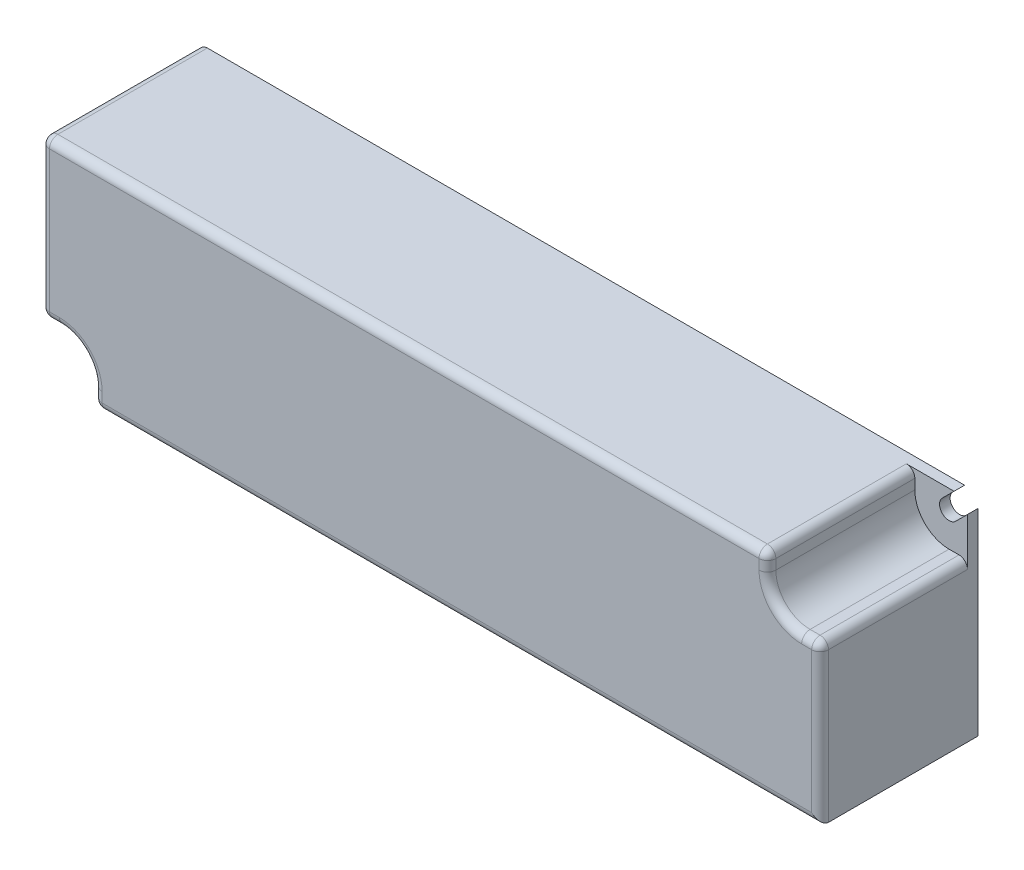
ISO-10303-21;
HEADER;
FILE_DESCRIPTION(('STEP AP214'),'2;1');
FILE_NAME('part.step','',(''),(''),'','','');
FILE_SCHEMA(('AUTOMOTIVE_DESIGN { 1 0 10303 214 1 1 1 1 }'));
ENDSEC;
DATA;
#1=APPLICATION_CONTEXT('core data for automotive mechanical design processes');
#2=APPLICATION_PROTOCOL_DEFINITION('international standard','automotive_design',2000,#1);
#3=PRODUCT_CONTEXT('',#1,'mechanical');
#4=PRODUCT('Part','Part','',(#3));
#5=PRODUCT_RELATED_PRODUCT_CATEGORY('part','',(#4));
#6=PRODUCT_DEFINITION_FORMATION('','',#4);
#7=PRODUCT_DEFINITION_CONTEXT('part definition',#1,'design');
#8=PRODUCT_DEFINITION('design','',#6,#7);
#9=PRODUCT_DEFINITION_SHAPE('','',#8);
#10=(LENGTH_UNIT() NAMED_UNIT(*) SI_UNIT(.MILLI.,.METRE.));
#11=(NAMED_UNIT(*) PLANE_ANGLE_UNIT() SI_UNIT($,.RADIAN.));
#12=(NAMED_UNIT(*) SI_UNIT($,.STERADIAN.) SOLID_ANGLE_UNIT());
#13=UNCERTAINTY_MEASURE_WITH_UNIT(LENGTH_MEASURE(1.E-05),#10,'distance_accuracy_value','');
#14=(GEOMETRIC_REPRESENTATION_CONTEXT(3) GLOBAL_UNCERTAINTY_ASSIGNED_CONTEXT((#13)) GLOBAL_UNIT_ASSIGNED_CONTEXT((#10,
#11,#12)) REPRESENTATION_CONTEXT('',''));
#15=CARTESIAN_POINT('',(0.,0.,0.));
#16=DIRECTION('',(0.,0.,1.));
#17=DIRECTION('',(1.,0.,0.));
#18=AXIS2_PLACEMENT_3D('',#15,#16,#17);
#19=CARTESIAN_POINT('',(-69.2272077938643,-17.7727922061353,0.));
#20=DIRECTION('',(0.707106781186543,-0.707106781186552,0.));
#21=DIRECTION('',(0.707106781186552,0.707106781186543,0.));
#22=AXIS2_PLACEMENT_3D('',#19,#20,#21);
#23=PLANE('',#22);
#24=DIRECTION('',(-0.707106781186552,-0.707106781186543,0.));
#25=VECTOR('',#24,1.);
#26=CARTESIAN_POINT('',(-69.2272077938643,-17.7727922061353,2.));
#27=LINE('',#26,#25);
#28=CARTESIAN_POINT('',(-69.2272077938643,-17.7727922061353,2.));
#29=VERTEX_POINT('',#28);
#30=CARTESIAN_POINT('',(-71.454415587729,-20.,2.));
#31=VERTEX_POINT('',#30);
#32=EDGE_CURVE('E248',#29,#31,#27,.T.);
#33=ORIENTED_EDGE('',*,*,#32,.F.);
#34=DIRECTION('',(0.,0.,1.));
#35=VECTOR('',#34,1.);
#36=CARTESIAN_POINT('',(-69.2272077938643,-17.7727922061353,0.));
#37=LINE('',#36,#35);
#38=CARTESIAN_POINT('',(-69.2272077938643,-17.7727922061353,0.));
#39=VERTEX_POINT('',#38);
#40=EDGE_CURVE('E282',#39,#29,#37,.T.);
#41=ORIENTED_EDGE('',*,*,#40,.F.);
#42=DIRECTION('',(0.707106781186552,0.707106781186543,0.));
#43=VECTOR('',#42,1.);
#44=CARTESIAN_POINT('',(-25.7272077938641,25.7272077938644,0.));
#45=LINE('',#44,#43);
#46=CARTESIAN_POINT('',(-71.454415587729,-20.,0.));
#47=VERTEX_POINT('',#46);
#48=EDGE_CURVE('E325',#47,#39,#45,.T.);
#49=ORIENTED_EDGE('',*,*,#48,.F.);
#50=DIRECTION('',(0.,0.,-1.));
#51=VECTOR('',#50,1.);
#52=CARTESIAN_POINT('',(-71.454415587729,-20.,30.));
#53=LINE('',#52,#51);
#54=EDGE_CURVE('E290',#31,#47,#53,.T.);
#55=ORIENTED_EDGE('',*,*,#54,.F.);
#56=EDGE_LOOP('',(#33,#41,#49,#55));
#57=FACE_BOUND('',#56,.T.);
#58=ADVANCED_FACE('F33',(#57),#23,.F.);
#59=CARTESIAN_POINT('',(-71.7727922061359,-15.2272077938637,0.));
#60=DIRECTION('',(-0.707106781186533,0.707106781186562,0.));
#61=DIRECTION('',(-0.707106781186562,-0.707106781186533,0.));
#62=AXIS2_PLACEMENT_3D('',#59,#60,#61);
#63=PLANE('',#62);
#64=DIRECTION('',(0.707106781186562,0.707106781186533,0.));
#65=VECTOR('',#64,1.);
#66=CARTESIAN_POINT('',(-71.7727922061359,-15.2272077938637,2.));
#67=LINE('',#66,#65);
#68=CARTESIAN_POINT('',(-74.,-17.4544155877278,2.));
#69=VERTEX_POINT('',#68);
#70=CARTESIAN_POINT('',(-71.7727922061359,-15.2272077938637,2.));
#71=VERTEX_POINT('',#70);
#72=EDGE_CURVE('E245',#69,#71,#67,.T.);
#73=ORIENTED_EDGE('',*,*,#72,.F.);
#74=DIRECTION('',(0.,0.,1.));
#75=VECTOR('',#74,1.);
#76=CARTESIAN_POINT('',(-74.,-17.4544155877278,30.));
#77=LINE('',#76,#75);
#78=CARTESIAN_POINT('',(-74.,-17.4544155877278,0.));
#79=VERTEX_POINT('',#78);
#80=EDGE_CURVE('E285',#79,#69,#77,.T.);
#81=ORIENTED_EDGE('',*,*,#80,.F.);
#82=DIRECTION('',(-0.707106781186562,-0.707106781186533,0.));
#83=VECTOR('',#82,1.);
#84=CARTESIAN_POINT('',(-71.7727922061359,-15.2272077938637,0.));
#85=LINE('',#84,#83);
#86=CARTESIAN_POINT('',(-71.7727922061359,-15.2272077938637,0.));
#87=VERTEX_POINT('',#86);
#88=EDGE_CURVE('E278',#87,#79,#85,.T.);
#89=ORIENTED_EDGE('',*,*,#88,.F.);
#90=DIRECTION('',(0.,0.,1.));
#91=VECTOR('',#90,1.);
#92=CARTESIAN_POINT('',(-71.7727922061359,-15.2272077938637,0.));
#93=LINE('',#92,#91);
#94=EDGE_CURVE('E281',#87,#71,#93,.T.);
#95=ORIENTED_EDGE('',*,*,#94,.T.);
#96=EDGE_LOOP('',(#73,#81,#89,#95));
#97=FACE_BOUND('',#96,.T.);
#98=ADVANCED_FACE('F486',(#97),#63,.F.);
#99=CARTESIAN_POINT('',(-70.5000000000001,-16.4999999999995,0.));
#100=DIRECTION('',(0.,0.,1.));
#101=DIRECTION('',(1.,0.,0.));
#102=AXIS2_PLACEMENT_3D('',#99,#100,#101);
#103=CYLINDRICAL_SURFACE('',#102,1.8);
#104=CARTESIAN_POINT('',(-70.5000000000001,-16.4999999999995,2.));
#105=DIRECTION('',(0.,0.,1.));
#106=DIRECTION('',(1.,0.,0.));
#107=AXIS2_PLACEMENT_3D('',#104,#105,#106);
#108=CIRCLE('',#107,1.8);
#109=EDGE_CURVE('E330',#71,#29,#108,.F.);
#110=ORIENTED_EDGE('',*,*,#109,.F.);
#111=ORIENTED_EDGE('',*,*,#94,.F.);
#112=CARTESIAN_POINT('',(-70.5000000000001,-16.4999999999995,0.));
#113=DIRECTION('',(0.,0.,1.));
#114=DIRECTION('',(1.,0.,0.));
#115=AXIS2_PLACEMENT_3D('',#112,#113,#114);
#116=CIRCLE('',#115,1.8);
#117=EDGE_CURVE('E275',#39,#87,#116,.T.);
#118=ORIENTED_EDGE('',*,*,#117,.F.);
#119=ORIENTED_EDGE('',*,*,#40,.T.);
#120=EDGE_LOOP('',(#110,#111,#118,#119));
#121=FACE_BOUND('',#120,.T.);
#122=ADVANCED_FACE('F490',(#121),#103,.F.);
#123=CARTESIAN_POINT('',(69.2272077938642,17.7727922061358,0.));
#124=DIRECTION('',(-0.707106781186548,0.707106781186547,0.));
#125=DIRECTION('',(-0.707106781186547,-0.707106781186548,0.));
#126=AXIS2_PLACEMENT_3D('',#123,#124,#125);
#127=PLANE('',#126);
#128=DIRECTION('',(0.707106781186547,0.707106781186548,0.));
#129=VECTOR('',#128,1.);
#130=CARTESIAN_POINT('',(69.2272077938642,17.7727922061358,2.));
#131=LINE('',#130,#129);
#132=CARTESIAN_POINT('',(69.2272077938642,17.7727922061358,2.));
#133=VERTEX_POINT('',#132);
#134=CARTESIAN_POINT('',(71.4544155877284,20.,2.));
#135=VERTEX_POINT('',#134);
#136=EDGE_CURVE('E269',#133,#135,#131,.T.);
#137=ORIENTED_EDGE('',*,*,#136,.F.);
#138=DIRECTION('',(0.,0.,1.));
#139=VECTOR('',#138,1.);
#140=CARTESIAN_POINT('',(69.2272077938642,17.7727922061358,0.));
#141=LINE('',#140,#139);
#142=CARTESIAN_POINT('',(69.2272077938642,17.7727922061358,0.));
#143=VERTEX_POINT('',#142);
#144=EDGE_CURVE('E299',#143,#133,#141,.T.);
#145=ORIENTED_EDGE('',*,*,#144,.F.);
#146=DIRECTION('',(-0.707106781186547,-0.707106781186548,0.));
#147=VECTOR('',#146,1.);
#148=CARTESIAN_POINT('',(25.7272077938643,-25.7272077938642,0.));
#149=LINE('',#148,#147);
#150=CARTESIAN_POINT('',(71.4544155877284,20.,0.));
#151=VERTEX_POINT('',#150);
#152=EDGE_CURVE('E322',#151,#143,#149,.T.);
#153=ORIENTED_EDGE('',*,*,#152,.F.);
#154=DIRECTION('',(0.,0.,-1.));
#155=VECTOR('',#154,1.);
#156=CARTESIAN_POINT('',(71.4544155877284,20.,30.));
#157=LINE('',#156,#155);
#158=EDGE_CURVE('E307',#135,#151,#157,.T.);
#159=ORIENTED_EDGE('',*,*,#158,.F.);
#160=EDGE_LOOP('',(#137,#145,#153,#159));
#161=FACE_BOUND('',#160,.T.);
#162=ADVANCED_FACE('F586',(#161),#127,.F.);
#163=CARTESIAN_POINT('',(71.7727922061358,15.2272077938642,0.));
#164=DIRECTION('',(0.707106781186538,-0.707106781186557,0.));
#165=DIRECTION('',(0.707106781186557,0.707106781186538,0.));
#166=AXIS2_PLACEMENT_3D('',#163,#164,#165);
#167=PLANE('',#166);
#168=DIRECTION('',(-0.707106781186557,-0.707106781186538,0.));
#169=VECTOR('',#168,1.);
#170=CARTESIAN_POINT('',(71.7727922061358,15.2272077938642,2.));
#171=LINE('',#170,#169);
#172=CARTESIAN_POINT('',(74.,17.4544155877284,2.));
#173=VERTEX_POINT('',#172);
#174=CARTESIAN_POINT('',(71.7727922061358,15.2272077938642,2.));
#175=VERTEX_POINT('',#174);
#176=EDGE_CURVE('E265',#173,#175,#171,.T.);
#177=ORIENTED_EDGE('',*,*,#176,.F.);
#178=DIRECTION('',(0.,0.,1.));
#179=VECTOR('',#178,1.);
#180=CARTESIAN_POINT('',(74.,17.4544155877284,30.));
#181=LINE('',#180,#179);
#182=CARTESIAN_POINT('',(74.,17.4544155877284,0.));
#183=VERTEX_POINT('',#182);
#184=EDGE_CURVE('E302',#183,#173,#181,.T.);
#185=ORIENTED_EDGE('',*,*,#184,.F.);
#186=DIRECTION('',(0.707106781186557,0.707106781186538,0.));
#187=VECTOR('',#186,1.);
#188=CARTESIAN_POINT('',(71.7727922061358,15.2272077938642,0.));
#189=LINE('',#188,#187);
#190=CARTESIAN_POINT('',(71.7727922061358,15.2272077938642,0.));
#191=VERTEX_POINT('',#190);
#192=EDGE_CURVE('E295',#191,#183,#189,.T.);
#193=ORIENTED_EDGE('',*,*,#192,.F.);
#194=DIRECTION('',(0.,0.,1.));
#195=VECTOR('',#194,1.);
#196=CARTESIAN_POINT('',(71.7727922061358,15.2272077938642,0.));
#197=LINE('',#196,#195);
#198=EDGE_CURVE('E298',#191,#175,#197,.T.);
#199=ORIENTED_EDGE('',*,*,#198,.T.);
#200=EDGE_LOOP('',(#177,#185,#193,#199));
#201=FACE_BOUND('',#200,.T.);
#202=ADVANCED_FACE('F578',(#201),#167,.F.);
#203=CARTESIAN_POINT('',(70.5,16.5,0.));
#204=DIRECTION('',(0.,0.,1.));
#205=DIRECTION('',(1.,0.,0.));
#206=AXIS2_PLACEMENT_3D('',#203,#204,#205);
#207=CYLINDRICAL_SURFACE('',#206,1.8);
#208=CARTESIAN_POINT('',(70.5,16.5,2.));
#209=DIRECTION('',(0.,0.,1.));
#210=DIRECTION('',(1.,0.,0.));
#211=AXIS2_PLACEMENT_3D('',#208,#209,#210);
#212=CIRCLE('',#211,1.8);
#213=EDGE_CURVE('E328',#175,#133,#212,.F.);
#214=ORIENTED_EDGE('',*,*,#213,.F.);
#215=ORIENTED_EDGE('',*,*,#198,.F.);
#216=CARTESIAN_POINT('',(70.5,16.5,0.));
#217=DIRECTION('',(0.,0.,1.));
#218=DIRECTION('',(1.,0.,0.));
#219=AXIS2_PLACEMENT_3D('',#216,#217,#218);
#220=CIRCLE('',#219,1.8);
#221=EDGE_CURVE('E292',#143,#191,#220,.T.);
#222=ORIENTED_EDGE('',*,*,#221,.F.);
#223=ORIENTED_EDGE('',*,*,#144,.T.);
#224=EDGE_LOOP('',(#214,#215,#222,#223));
#225=FACE_BOUND('',#224,.T.);
#226=ADVANCED_FACE('F581',(#225),#207,.F.);
#227=CARTESIAN_POINT('',(74.,20.,30.));
#228=DIRECTION('',(-1.,0.,0.));
#229=DIRECTION('',(0.,-1.,0.));
#230=AXIS2_PLACEMENT_3D('',#227,#228,#229);
#231=PLANE('',#230);
#232=DIRECTION('',(0.,1.,0.));
#233=VECTOR('',#232,1.);
#234=CARTESIAN_POINT('',(74.,20.,2.));
#235=LINE('',#234,#233);
#236=CARTESIAN_POINT('',(74.,8.40000000000001,2.));
#237=VERTEX_POINT('',#236);
#238=EDGE_CURVE('E273',#237,#173,#235,.T.);
#239=ORIENTED_EDGE('',*,*,#238,.F.);
#240=DIRECTION('',(0.,0.,1.));
#241=VECTOR('',#240,1.);
#242=CARTESIAN_POINT('',(74.,8.40000000000001,30.));
#243=LINE('',#242,#241);
#244=CARTESIAN_POINT('',(74.,8.40000000000001,28.4));
#245=VERTEX_POINT('',#244);
#246=EDGE_CURVE('E371',#237,#245,#243,.T.);
#247=ORIENTED_EDGE('',*,*,#246,.T.);
#248=DIRECTION('',(0.,1.,0.));
#249=VECTOR('',#248,1.);
#250=CARTESIAN_POINT('',(74.,-20.,28.4));
#251=LINE('',#250,#249);
#252=CARTESIAN_POINT('',(74.,-20.,28.4));
#253=VERTEX_POINT('',#252);
#254=EDGE_CURVE('E369',#245,#253,#251,.F.);
#255=ORIENTED_EDGE('',*,*,#254,.T.);
#256=DIRECTION('',(0.,0.,-1.));
#257=VECTOR('',#256,1.);
#258=CARTESIAN_POINT('',(74.,-20.,30.));
#259=LINE('',#258,#257);
#260=CARTESIAN_POINT('',(74.,-20.,0.));
#261=VERTEX_POINT('',#260);
#262=EDGE_CURVE('E320',#253,#261,#259,.T.);
#263=ORIENTED_EDGE('',*,*,#262,.T.);
#264=DIRECTION('',(0.,1.,0.));
#265=VECTOR('',#264,1.);
#266=CARTESIAN_POINT('',(74.,20.,0.));
#267=LINE('',#266,#265);
#268=EDGE_CURVE('E309',#261,#183,#267,.T.);
#269=ORIENTED_EDGE('',*,*,#268,.T.);
#270=ORIENTED_EDGE('',*,*,#184,.T.);
#271=EDGE_LOOP('',(#239,#247,#255,#263,#269,#270));
#272=FACE_BOUND('',#271,.T.);
#273=ADVANCED_FACE('F533',(#272),#231,.F.);
#274=CARTESIAN_POINT('',(-74.,20.,30.));
#275=DIRECTION('',(0.,-1.,0.));
#276=DIRECTION('',(0.,0.,-1.));
#277=AXIS2_PLACEMENT_3D('',#274,#275,#276);
#278=PLANE('',#277);
#279=DIRECTION('',(0.,0.,-1.));
#280=VECTOR('',#279,1.);
#281=CARTESIAN_POINT('',(62.4,20.,30.));
#282=LINE('',#281,#280);
#283=CARTESIAN_POINT('',(62.4,20.,28.4));
#284=VERTEX_POINT('',#283);
#285=CARTESIAN_POINT('',(62.4,20.,2.));
#286=VERTEX_POINT('',#285);
#287=EDGE_CURVE('E379',#284,#286,#282,.T.);
#288=ORIENTED_EDGE('',*,*,#287,.T.);
#289=DIRECTION('',(-1.,0.,0.));
#290=VECTOR('',#289,1.);
#291=CARTESIAN_POINT('',(-74.,20.,2.));
#292=LINE('',#291,#290);
#293=EDGE_CURVE('E271',#135,#286,#292,.T.);
#294=ORIENTED_EDGE('',*,*,#293,.F.);
#295=ORIENTED_EDGE('',*,*,#158,.T.);
#296=DIRECTION('',(-1.,0.,0.));
#297=VECTOR('',#296,1.);
#298=CARTESIAN_POINT('',(-74.,20.,0.));
#299=LINE('',#298,#297);
#300=CARTESIAN_POINT('',(-72.4,20.,0.));
#301=VERTEX_POINT('',#300);
#302=EDGE_CURVE('E312',#151,#301,#299,.T.);
#303=ORIENTED_EDGE('',*,*,#302,.T.);
#304=DIRECTION('',(0.,0.,-1.));
#305=VECTOR('',#304,1.);
#306=CARTESIAN_POINT('',(-72.4,20.,30.));
#307=LINE('',#306,#305);
#308=CARTESIAN_POINT('',(-72.4,20.,28.4));
#309=VERTEX_POINT('',#308);
#310=EDGE_CURVE('E377',#301,#309,#307,.F.);
#311=ORIENTED_EDGE('',*,*,#310,.T.);
#312=DIRECTION('',(-1.,0.,0.));
#313=VECTOR('',#312,1.);
#314=CARTESIAN_POINT('',(64.,20.,28.4));
#315=LINE('',#314,#313);
#316=EDGE_CURVE('E375',#309,#284,#315,.F.);
#317=ORIENTED_EDGE('',*,*,#316,.T.);
#318=EDGE_LOOP('',(#288,#294,#295,#303,#311,#317));
#319=FACE_BOUND('',#318,.T.);
#320=ADVANCED_FACE('F589',(#319),#278,.F.);
#321=CARTESIAN_POINT('',(-74.,20.,30.));
#322=DIRECTION('',(1.,0.,0.));
#323=DIRECTION('',(0.,0.,-1.));
#324=AXIS2_PLACEMENT_3D('',#321,#322,#323);
#325=PLANE('',#324);
#326=DIRECTION('',(0.,-1.,0.));
#327=VECTOR('',#326,1.);
#328=CARTESIAN_POINT('',(-74.,20.,2.));
#329=LINE('',#328,#327);
#330=CARTESIAN_POINT('',(-74.,-8.39999999999917,2.));
#331=VERTEX_POINT('',#330);
#332=EDGE_CURVE('E251',#331,#69,#329,.T.);
#333=ORIENTED_EDGE('',*,*,#332,.F.);
#334=DIRECTION('',(0.,0.,1.));
#335=VECTOR('',#334,1.);
#336=CARTESIAN_POINT('',(-74.,-8.39999999999917,30.));
#337=LINE('',#336,#335);
#338=CARTESIAN_POINT('',(-74.,-8.39999999999917,28.4));
#339=VERTEX_POINT('',#338);
#340=EDGE_CURVE('E384',#331,#339,#337,.T.);
#341=ORIENTED_EDGE('',*,*,#340,.T.);
#342=DIRECTION('',(0.,-1.,0.));
#343=VECTOR('',#342,1.);
#344=CARTESIAN_POINT('',(-74.,20.,28.4));
#345=LINE('',#344,#343);
#346=CARTESIAN_POINT('',(-74.,18.4,28.4));
#347=VERTEX_POINT('',#346);
#348=EDGE_CURVE('E382',#339,#347,#345,.F.);
#349=ORIENTED_EDGE('',*,*,#348,.T.);
#350=DIRECTION('',(0.,0.,-1.));
#351=VECTOR('',#350,1.);
#352=CARTESIAN_POINT('',(-74.,18.4,30.));
#353=LINE('',#352,#351);
#354=CARTESIAN_POINT('',(-74.,18.4,0.));
#355=VERTEX_POINT('',#354);
#356=EDGE_CURVE('E386',#347,#355,#353,.T.);
#357=ORIENTED_EDGE('',*,*,#356,.T.);
#358=DIRECTION('',(0.,-1.,0.));
#359=VECTOR('',#358,1.);
#360=CARTESIAN_POINT('',(-74.,20.,0.));
#361=LINE('',#360,#359);
#362=EDGE_CURVE('E315',#355,#79,#361,.T.);
#363=ORIENTED_EDGE('',*,*,#362,.T.);
#364=ORIENTED_EDGE('',*,*,#80,.T.);
#365=EDGE_LOOP('',(#333,#341,#349,#357,#363,#364));
#366=FACE_BOUND('',#365,.T.);
#367=ADVANCED_FACE('F479',(#366),#325,.F.);
#368=CARTESIAN_POINT('',(-74.,-20.,30.));
#369=DIRECTION('',(0.,1.,0.));
#370=DIRECTION('',(0.,0.,1.));
#371=AXIS2_PLACEMENT_3D('',#368,#369,#370);
#372=PLANE('',#371);
#373=ORIENTED_EDGE('',*,*,#262,.F.);
#374=DIRECTION('',(1.,0.,0.));
#375=VECTOR('',#374,1.);
#376=CARTESIAN_POINT('',(-64.0000000000002,-20.,28.4));
#377=LINE('',#376,#375);
#378=CARTESIAN_POINT('',(-62.4000000000001,-20.,28.4));
#379=VERTEX_POINT('',#378);
#380=EDGE_CURVE('E50',#253,#379,#377,.F.);
#381=ORIENTED_EDGE('',*,*,#380,.T.);
#382=DIRECTION('',(0.,0.,-1.));
#383=VECTOR('',#382,1.);
#384=CARTESIAN_POINT('',(-62.4000000000001,-20.,30.));
#385=LINE('',#384,#383);
#386=CARTESIAN_POINT('',(-62.4000000000001,-20.,2.));
#387=VERTEX_POINT('',#386);
#388=EDGE_CURVE('E390',#379,#387,#385,.T.);
#389=ORIENTED_EDGE('',*,*,#388,.T.);
#390=DIRECTION('',(1.,0.,0.));
#391=VECTOR('',#390,1.);
#392=CARTESIAN_POINT('',(-74.,-20.,2.));
#393=LINE('',#392,#391);
#394=EDGE_CURVE('E57',#31,#387,#393,.T.);
#395=ORIENTED_EDGE('',*,*,#394,.F.);
#396=ORIENTED_EDGE('',*,*,#54,.T.);
#397=DIRECTION('',(1.,0.,0.));
#398=VECTOR('',#397,1.);
#399=CARTESIAN_POINT('',(-74.,-20.,0.));
#400=LINE('',#399,#398);
#401=EDGE_CURVE('E317',#47,#261,#400,.T.);
#402=ORIENTED_EDGE('',*,*,#401,.T.);
#403=EDGE_LOOP('',(#373,#381,#389,#395,#396,#402));
#404=FACE_BOUND('',#403,.T.);
#405=ADVANCED_FACE('F496',(#404),#372,.F.);
#406=CARTESIAN_POINT('',(0.,0.,30.));
#407=DIRECTION('',(0.,0.,1.));
#408=DIRECTION('',(1.,0.,0.));
#409=AXIS2_PLACEMENT_3D('',#406,#407,#408);
#410=PLANE('',#409);
#411=DIRECTION('',(1.,0.,0.));
#412=VECTOR('',#411,1.);
#413=CARTESIAN_POINT('',(74.,-18.4,30.));
#414=LINE('',#413,#412);
#415=CARTESIAN_POINT('',(-62.4000000000001,-18.4,30.));
#416=VERTEX_POINT('',#415);
#417=CARTESIAN_POINT('',(72.4,-18.4,30.));
#418=VERTEX_POINT('',#417);
#419=EDGE_CURVE('E354',#416,#418,#414,.T.);
#420=ORIENTED_EDGE('',*,*,#419,.T.);
#421=DIRECTION('',(0.,1.,0.));
#422=VECTOR('',#421,1.);
#423=CARTESIAN_POINT('',(72.4,10.,30.));
#424=LINE('',#423,#422);
#425=CARTESIAN_POINT('',(72.4,8.40000000000001,30.));
#426=VERTEX_POINT('',#425);
#427=EDGE_CURVE('E356',#418,#426,#424,.T.);
#428=ORIENTED_EDGE('',*,*,#427,.T.);
#429=DIRECTION('',(1.,0.,0.));
#430=VECTOR('',#429,1.);
#431=CARTESIAN_POINT('',(70.5,8.40000000000001,30.));
#432=LINE('',#431,#430);
#433=CARTESIAN_POINT('',(70.5,8.40000000000003,30.));
#434=VERTEX_POINT('',#433);
#435=EDGE_CURVE('E352',#426,#434,#432,.F.);
#436=ORIENTED_EDGE('',*,*,#435,.T.);
#437=CARTESIAN_POINT('',(70.5,16.5,30.));
#438=DIRECTION('',(0.,0.,1.));
#439=DIRECTION('',(1.,0.,0.));
#440=AXIS2_PLACEMENT_3D('',#437,#438,#439);
#441=CIRCLE('',#440,8.10000000000001);
#442=CARTESIAN_POINT('',(62.4,16.5,30.));
#443=VERTEX_POINT('',#442);
#444=EDGE_CURVE('E348',#434,#443,#441,.F.);
#445=ORIENTED_EDGE('',*,*,#444,.T.);
#446=DIRECTION('',(0.,-1.,0.));
#447=VECTOR('',#446,1.);
#448=CARTESIAN_POINT('',(62.4,20.,30.));
#449=LINE('',#448,#447);
#450=CARTESIAN_POINT('',(62.4,18.4,30.));
#451=VERTEX_POINT('',#450);
#452=EDGE_CURVE('E343',#443,#451,#449,.F.);
#453=ORIENTED_EDGE('',*,*,#452,.T.);
#454=DIRECTION('',(-1.,0.,0.));
#455=VECTOR('',#454,1.);
#456=CARTESIAN_POINT('',(-74.,18.4,30.));
#457=LINE('',#456,#455);
#458=CARTESIAN_POINT('',(-72.4,18.4,30.));
#459=VERTEX_POINT('',#458);
#460=EDGE_CURVE('E339',#451,#459,#457,.T.);
#461=ORIENTED_EDGE('',*,*,#460,.T.);
#462=DIRECTION('',(0.,-1.,0.));
#463=VECTOR('',#462,1.);
#464=CARTESIAN_POINT('',(-72.4,-9.99999999999888,30.));
#465=LINE('',#464,#463);
#466=CARTESIAN_POINT('',(-72.4,-8.39999999999917,30.));
#467=VERTEX_POINT('',#466);
#468=EDGE_CURVE('E337',#459,#467,#465,.T.);
#469=ORIENTED_EDGE('',*,*,#468,.T.);
#470=DIRECTION('',(-1.,1.80743720280802E-13,0.));
#471=VECTOR('',#470,1.);
#472=CARTESIAN_POINT('',(-70.4999999999998,-8.39999999999951,30.));
#473=LINE('',#472,#471);
#474=CARTESIAN_POINT('',(-70.4999999999998,-8.39999999999951,30.));
#475=VERTEX_POINT('',#474);
#476=EDGE_CURVE('E341',#467,#475,#473,.F.);
#477=ORIENTED_EDGE('',*,*,#476,.T.);
#478=CARTESIAN_POINT('',(-70.5000000000001,-16.4999999999995,30.));
#479=DIRECTION('',(0.,0.,1.));
#480=DIRECTION('',(1.,0.,0.));
#481=AXIS2_PLACEMENT_3D('',#478,#479,#480);
#482=CIRCLE('',#481,8.10000000000001);
#483=CARTESIAN_POINT('',(-62.4000000000001,-16.4999999999996,30.));
#484=VERTEX_POINT('',#483);
#485=EDGE_CURVE('E346',#475,#484,#482,.F.);
#486=ORIENTED_EDGE('',*,*,#485,.T.);
#487=DIRECTION('',(0.,1.,0.));
#488=VECTOR('',#487,1.);
#489=CARTESIAN_POINT('',(-62.4000000000002,-20.,30.));
#490=LINE('',#489,#488);
#491=EDGE_CURVE('E350',#484,#416,#490,.F.);
#492=ORIENTED_EDGE('',*,*,#491,.T.);
#493=EDGE_LOOP('',(#420,#428,#436,#445,#453,#461,#469,#477,#486,#492));
#494=FACE_BOUND('',#493,.T.);
#495=ADVANCED_FACE('F509',(#494),#410,.T.);
#496=CARTESIAN_POINT('',(0.,0.,0.));
#497=DIRECTION('',(0.,0.,1.));
#498=DIRECTION('',(1.,0.,0.));
#499=AXIS2_PLACEMENT_3D('',#496,#497,#498);
#500=PLANE('',#499);
#501=ORIENTED_EDGE('',*,*,#362,.F.);
#502=CARTESIAN_POINT('',(-72.4,18.4,0.));
#503=DIRECTION('',(0.,0.,1.));
#504=DIRECTION('',(1.,0.,0.));
#505=AXIS2_PLACEMENT_3D('',#502,#503,#504);
#506=CIRCLE('',#505,1.6);
#507=EDGE_CURVE('E388',#355,#301,#506,.F.);
#508=ORIENTED_EDGE('',*,*,#507,.T.);
#509=ORIENTED_EDGE('',*,*,#302,.F.);
#510=ORIENTED_EDGE('',*,*,#152,.T.);
#511=ORIENTED_EDGE('',*,*,#221,.T.);
#512=ORIENTED_EDGE('',*,*,#192,.T.);
#513=ORIENTED_EDGE('',*,*,#268,.F.);
#514=ORIENTED_EDGE('',*,*,#401,.F.);
#515=ORIENTED_EDGE('',*,*,#48,.T.);
#516=ORIENTED_EDGE('',*,*,#117,.T.);
#517=ORIENTED_EDGE('',*,*,#88,.T.);
#518=EDGE_LOOP('',(#501,#508,#509,#510,#511,#512,#513,#514,#515,#516,#517));
#519=FACE_BOUND('',#518,.T.);
#520=ADVANCED_FACE('F529',(#519),#500,.F.);
#521=CARTESIAN_POINT('',(70.5,10.,2.));
#522=DIRECTION('',(0.,-1.,0.));
#523=DIRECTION('',(0.,0.,-1.));
#524=AXIS2_PLACEMENT_3D('',#521,#522,#523);
#525=PLANE('',#524);
#526=DIRECTION('',(0.,0.,1.));
#527=VECTOR('',#526,1.);
#528=CARTESIAN_POINT('',(70.5,10.,2.));
#529=LINE('',#528,#527);
#530=CARTESIAN_POINT('',(70.5,10.,2.));
#531=VERTEX_POINT('',#530);
#532=CARTESIAN_POINT('',(70.5,10.,28.4));
#533=VERTEX_POINT('',#532);
#534=EDGE_CURVE('E262',#531,#533,#529,.T.);
#535=ORIENTED_EDGE('',*,*,#534,.T.);
#536=DIRECTION('',(1.,0.,0.));
#537=VECTOR('',#536,1.);
#538=CARTESIAN_POINT('',(74.,10.,28.4));
#539=LINE('',#538,#537);
#540=CARTESIAN_POINT('',(72.4,10.,28.4));
#541=VERTEX_POINT('',#540);
#542=EDGE_CURVE('E360',#533,#541,#539,.T.);
#543=ORIENTED_EDGE('',*,*,#542,.T.);
#544=DIRECTION('',(0.,0.,1.));
#545=VECTOR('',#544,1.);
#546=CARTESIAN_POINT('',(72.4,10.,2.));
#547=LINE('',#546,#545);
#548=CARTESIAN_POINT('',(72.4,10.,2.));
#549=VERTEX_POINT('',#548);
#550=EDGE_CURVE('E358',#541,#549,#547,.F.);
#551=ORIENTED_EDGE('',*,*,#550,.T.);
#552=DIRECTION('',(1.,0.,0.));
#553=VECTOR('',#552,1.);
#554=CARTESIAN_POINT('',(70.5,10.,2.));
#555=LINE('',#554,#553);
#556=EDGE_CURVE('E258',#531,#549,#555,.T.);
#557=ORIENTED_EDGE('',*,*,#556,.F.);
#558=EDGE_LOOP('',(#535,#543,#551,#557));
#559=FACE_BOUND('',#558,.T.);
#560=ADVANCED_FACE('F570',(#559),#525,.F.);
#561=CARTESIAN_POINT('',(64.,27.706839184826,2.));
#562=DIRECTION('',(-1.,0.,0.));
#563=DIRECTION('',(0.,0.,1.));
#564=AXIS2_PLACEMENT_3D('',#561,#562,#563);
#565=PLANE('',#564);
#566=DIRECTION('',(0.,0.,-1.));
#567=VECTOR('',#566,1.);
#568=CARTESIAN_POINT('',(64.,18.4,2.));
#569=LINE('',#568,#567);
#570=CARTESIAN_POINT('',(64.,18.4,2.));
#571=VERTEX_POINT('',#570);
#572=CARTESIAN_POINT('',(64.,18.4,28.4));
#573=VERTEX_POINT('',#572);
#574=EDGE_CURVE('E332',#571,#573,#569,.F.);
#575=ORIENTED_EDGE('',*,*,#574,.T.);
#576=DIRECTION('',(0.,-1.,0.));
#577=VECTOR('',#576,1.);
#578=CARTESIAN_POINT('',(64.,16.5,28.4));
#579=LINE('',#578,#577);
#580=CARTESIAN_POINT('',(64.,16.5,28.4));
#581=VERTEX_POINT('',#580);
#582=EDGE_CURVE('E334',#573,#581,#579,.T.);
#583=ORIENTED_EDGE('',*,*,#582,.T.);
#584=DIRECTION('',(0.,0.,1.));
#585=VECTOR('',#584,1.);
#586=CARTESIAN_POINT('',(64.,16.5,2.));
#587=LINE('',#586,#585);
#588=CARTESIAN_POINT('',(64.,16.5,2.));
#589=VERTEX_POINT('',#588);
#590=EDGE_CURVE('E261',#589,#581,#587,.T.);
#591=ORIENTED_EDGE('',*,*,#590,.F.);
#592=DIRECTION('',(0.,-1.,0.));
#593=VECTOR('',#592,1.);
#594=CARTESIAN_POINT('',(64.,27.706839184826,2.));
#595=LINE('',#594,#593);
#596=EDGE_CURVE('E253',#571,#589,#595,.T.);
#597=ORIENTED_EDGE('',*,*,#596,.F.);
#598=EDGE_LOOP('',(#575,#583,#591,#597));
#599=FACE_BOUND('',#598,.T.);
#600=ADVANCED_FACE('F559',(#599),#565,.F.);
#601=CARTESIAN_POINT('',(70.5,16.5,2.));
#602=DIRECTION('',(0.,0.,1.));
#603=DIRECTION('',(1.,0.,0.));
#604=AXIS2_PLACEMENT_3D('',#601,#602,#603);
#605=PLANE('',#604);
#606=ORIENTED_EDGE('',*,*,#238,.T.);
#607=ORIENTED_EDGE('',*,*,#176,.T.);
#608=ORIENTED_EDGE('',*,*,#213,.T.);
#609=ORIENTED_EDGE('',*,*,#136,.T.);
#610=ORIENTED_EDGE('',*,*,#293,.T.);
#611=CARTESIAN_POINT('',(62.4,18.4,2.));
#612=DIRECTION('',(0.,0.,1.));
#613=DIRECTION('',(1.,0.,0.));
#614=AXIS2_PLACEMENT_3D('',#611,#612,#613);
#615=CIRCLE('',#614,1.6);
#616=EDGE_CURVE('E398',#286,#571,#615,.F.);
#617=ORIENTED_EDGE('',*,*,#616,.T.);
#618=ORIENTED_EDGE('',*,*,#596,.T.);
#619=CARTESIAN_POINT('',(70.5,16.5,2.));
#620=DIRECTION('',(0.,0.,1.));
#621=DIRECTION('',(1.,0.,0.));
#622=AXIS2_PLACEMENT_3D('',#619,#620,#621);
#623=CIRCLE('',#622,6.50000000000001);
#624=EDGE_CURVE('E255',#589,#531,#623,.T.);
#625=ORIENTED_EDGE('',*,*,#624,.T.);
#626=ORIENTED_EDGE('',*,*,#556,.T.);
#627=CARTESIAN_POINT('',(72.4,8.40000000000001,2.));
#628=DIRECTION('',(0.,0.,1.));
#629=DIRECTION('',(1.,0.,0.));
#630=AXIS2_PLACEMENT_3D('',#627,#628,#629);
#631=CIRCLE('',#630,1.6);
#632=EDGE_CURVE('E395',#549,#237,#631,.F.);
#633=ORIENTED_EDGE('',*,*,#632,.T.);
#634=EDGE_LOOP('',(#606,#607,#608,#609,#610,#617,#618,#625,#626,#633));
#635=FACE_BOUND('',#634,.T.);
#636=ADVANCED_FACE('F567',(#635),#605,.T.);
#637=CARTESIAN_POINT('',(70.5,16.5,2.));
#638=DIRECTION('',(0.,0.,1.));
#639=DIRECTION('',(1.,0.,0.));
#640=AXIS2_PLACEMENT_3D('',#637,#638,#639);
#641=CYLINDRICAL_SURFACE('',#640,6.50000000000001);
#642=ORIENTED_EDGE('',*,*,#590,.T.);
#643=CARTESIAN_POINT('',(70.5,16.5,28.4));
#644=DIRECTION('',(0.,0.,1.));
#645=DIRECTION('',(1.,0.,0.));
#646=AXIS2_PLACEMENT_3D('',#643,#644,#645);
#647=CIRCLE('',#646,6.50000000000001);
#648=EDGE_CURVE('E373',#581,#533,#647,.T.);
#649=ORIENTED_EDGE('',*,*,#648,.T.);
#650=ORIENTED_EDGE('',*,*,#534,.F.);
#651=ORIENTED_EDGE('',*,*,#624,.F.);
#652=EDGE_LOOP('',(#642,#649,#650,#651));
#653=FACE_BOUND('',#652,.T.);
#654=ADVANCED_FACE('F564',(#653),#641,.F.);
#655=CARTESIAN_POINT('',(-70.5000000000001,-9.99999999999952,2.));
#656=DIRECTION('',(1.80743720280802E-13,1.,0.));
#657=DIRECTION('',(-1.,1.80743720280802E-13,0.));
#658=AXIS2_PLACEMENT_3D('',#655,#656,#657);
#659=PLANE('',#658);
#660=DIRECTION('',(0.,0.,1.));
#661=VECTOR('',#660,1.);
#662=CARTESIAN_POINT('',(-70.5000000000001,-9.99999999999953,2.));
#663=LINE('',#662,#661);
#664=CARTESIAN_POINT('',(-70.5000000000001,-9.99999999999953,2.));
#665=VERTEX_POINT('',#664);
#666=CARTESIAN_POINT('',(-70.5000000000001,-9.99999999999953,28.4));
#667=VERTEX_POINT('',#666);
#668=EDGE_CURVE('E237',#665,#667,#663,.T.);
#669=ORIENTED_EDGE('',*,*,#668,.T.);
#670=DIRECTION('',(-1.,1.80743720280802E-13,0.));
#671=VECTOR('',#670,1.);
#672=CARTESIAN_POINT('',(-74.,-9.99999999999888,28.4));
#673=LINE('',#672,#671);
#674=CARTESIAN_POINT('',(-72.4000000000003,-9.99999999999917,28.4));
#675=VERTEX_POINT('',#674);
#676=EDGE_CURVE('E367',#667,#675,#673,.T.);
#677=ORIENTED_EDGE('',*,*,#676,.T.);
#678=DIRECTION('',(0.,0.,1.));
#679=VECTOR('',#678,1.);
#680=CARTESIAN_POINT('',(-72.4000000000003,-9.99999999999917,2.));
#681=LINE('',#680,#679);
#682=CARTESIAN_POINT('',(-72.4000000000003,-9.99999999999917,2.));
#683=VERTEX_POINT('',#682);
#684=EDGE_CURVE('E365',#675,#683,#681,.F.);
#685=ORIENTED_EDGE('',*,*,#684,.T.);
#686=DIRECTION('',(-1.,1.80743720280802E-13,0.));
#687=VECTOR('',#686,1.);
#688=CARTESIAN_POINT('',(-70.5000000000001,-9.99999999999952,2.));
#689=LINE('',#688,#687);
#690=EDGE_CURVE('E238',#665,#683,#689,.T.);
#691=ORIENTED_EDGE('',*,*,#690,.F.);
#692=EDGE_LOOP('',(#669,#677,#685,#691));
#693=FACE_BOUND('',#692,.T.);
#694=ADVANCED_FACE('F469',(#693),#659,.F.);
#695=CARTESIAN_POINT('',(-64.0000000000002,-27.7068391848256,2.));
#696=DIRECTION('',(1.,0.,0.));
#697=DIRECTION('',(0.,1.,0.));
#698=AXIS2_PLACEMENT_3D('',#695,#696,#697);
#699=PLANE('',#698);
#700=DIRECTION('',(0.,0.,-1.));
#701=VECTOR('',#700,1.);
#702=CARTESIAN_POINT('',(-64.0000000000001,-18.4,2.));
#703=LINE('',#702,#701);
#704=CARTESIAN_POINT('',(-64.0000000000001,-18.4,2.));
#705=VERTEX_POINT('',#704);
#706=CARTESIAN_POINT('',(-64.0000000000001,-18.4,28.4));
#707=VERTEX_POINT('',#706);
#708=EDGE_CURVE('E362',#705,#707,#703,.F.);
#709=ORIENTED_EDGE('',*,*,#708,.T.);
#710=DIRECTION('',(0.,1.,0.));
#711=VECTOR('',#710,1.);
#712=CARTESIAN_POINT('',(-64.0000000000001,-16.4999999999996,28.4));
#713=LINE('',#712,#711);
#714=CARTESIAN_POINT('',(-64.0000000000001,-16.4999999999996,28.4));
#715=VERTEX_POINT('',#714);
#716=EDGE_CURVE('E234',#707,#715,#713,.T.);
#717=ORIENTED_EDGE('',*,*,#716,.T.);
#718=DIRECTION('',(0.,0.,1.));
#719=VECTOR('',#718,1.);
#720=CARTESIAN_POINT('',(-64.0000000000001,-16.4999999999996,2.));
#721=LINE('',#720,#719);
#722=CARTESIAN_POINT('',(-64.0000000000001,-16.4999999999996,2.));
#723=VERTEX_POINT('',#722);
#724=EDGE_CURVE('E231',#723,#715,#721,.T.);
#725=ORIENTED_EDGE('',*,*,#724,.F.);
#726=DIRECTION('',(0.,1.,0.));
#727=VECTOR('',#726,1.);
#728=CARTESIAN_POINT('',(-64.0000000000002,-27.7068391848256,2.));
#729=LINE('',#728,#727);
#730=EDGE_CURVE('E219',#705,#723,#729,.T.);
#731=ORIENTED_EDGE('',*,*,#730,.F.);
#732=EDGE_LOOP('',(#709,#717,#725,#731));
#733=FACE_BOUND('',#732,.T.);
#734=ADVANCED_FACE('F232',(#733),#699,.F.);
#735=CARTESIAN_POINT('',(-70.5000000000001,-16.4999999999995,2.));
#736=DIRECTION('',(0.,0.,1.));
#737=DIRECTION('',(1.,0.,0.));
#738=AXIS2_PLACEMENT_3D('',#735,#736,#737);
#739=PLANE('',#738);
#740=ORIENTED_EDGE('',*,*,#332,.T.);
#741=ORIENTED_EDGE('',*,*,#72,.T.);
#742=ORIENTED_EDGE('',*,*,#109,.T.);
#743=ORIENTED_EDGE('',*,*,#32,.T.);
#744=ORIENTED_EDGE('',*,*,#394,.T.);
#745=CARTESIAN_POINT('',(-62.4000000000001,-18.4,2.));
#746=DIRECTION('',(0.,0.,1.));
#747=DIRECTION('',(1.,0.,0.));
#748=AXIS2_PLACEMENT_3D('',#745,#746,#747);
#749=CIRCLE('',#748,1.6);
#750=EDGE_CURVE('E11',#387,#705,#749,.F.);
#751=ORIENTED_EDGE('',*,*,#750,.T.);
#752=ORIENTED_EDGE('',*,*,#730,.T.);
#753=CARTESIAN_POINT('',(-70.5000000000001,-16.4999999999995,2.));
#754=DIRECTION('',(0.,0.,1.));
#755=DIRECTION('',(1.,0.,0.));
#756=AXIS2_PLACEMENT_3D('',#753,#754,#755);
#757=CIRCLE('',#756,6.50000000000001);
#758=EDGE_CURVE('E224',#723,#665,#757,.T.);
#759=ORIENTED_EDGE('',*,*,#758,.T.);
#760=ORIENTED_EDGE('',*,*,#690,.T.);
#761=CARTESIAN_POINT('',(-72.4,-8.39999999999917,2.));
#762=DIRECTION('',(0.,0.,1.));
#763=DIRECTION('',(1.,0.,0.));
#764=AXIS2_PLACEMENT_3D('',#761,#762,#763);
#765=CIRCLE('',#764,1.6);
#766=EDGE_CURVE('E42',#683,#331,#765,.F.);
#767=ORIENTED_EDGE('',*,*,#766,.T.);
#768=EDGE_LOOP('',(#740,#741,#742,#743,#744,#751,#752,#759,#760,#767));
#769=FACE_BOUND('',#768,.T.);
#770=ADVANCED_FACE('F221',(#769),#739,.T.);
#771=CARTESIAN_POINT('',(-70.5000000000001,-16.4999999999995,2.));
#772=DIRECTION('',(0.,0.,1.));
#773=DIRECTION('',(1.,0.,0.));
#774=AXIS2_PLACEMENT_3D('',#771,#772,#773);
#775=CYLINDRICAL_SURFACE('',#774,6.50000000000001);
#776=ORIENTED_EDGE('',*,*,#724,.T.);
#777=CARTESIAN_POINT('',(-70.5000000000001,-16.4999999999995,28.4));
#778=DIRECTION('',(0.,0.,1.));
#779=DIRECTION('',(1.,0.,0.));
#780=AXIS2_PLACEMENT_3D('',#777,#778,#779);
#781=CIRCLE('',#780,6.50000000000001);
#782=EDGE_CURVE('E393',#715,#667,#781,.T.);
#783=ORIENTED_EDGE('',*,*,#782,.T.);
#784=ORIENTED_EDGE('',*,*,#668,.F.);
#785=ORIENTED_EDGE('',*,*,#758,.F.);
#786=EDGE_LOOP('',(#776,#783,#784,#785));
#787=FACE_BOUND('',#786,.T.);
#788=ADVANCED_FACE('F240',(#787),#775,.F.);
#789=CARTESIAN_POINT('',(-70.5000000000001,-16.4999999999995,28.4));
#790=DIRECTION('',(0.,0.,1.));
#791=DIRECTION('',(1.,0.,0.));
#792=AXIS2_PLACEMENT_3D('',#789,#790,#791);
#793=TOROIDAL_SURFACE('',#792,8.10000000000001,1.6);
#794=CARTESIAN_POINT('',(-70.5000000000001,-8.39999999999953,28.4));
#795=DIRECTION('',(-1.,0.,1.73472347597681E-13));
#796=DIRECTION('',(1.73472347597681E-13,0.,1.));
#797=AXIS2_PLACEMENT_3D('',#794,#795,#796);
#798=CIRCLE('',#797,1.6);
#799=EDGE_CURVE('E453',#667,#475,#798,.T.);
#800=ORIENTED_EDGE('',*,*,#799,.F.);
#801=ORIENTED_EDGE('',*,*,#782,.F.);
#802=CARTESIAN_POINT('',(-62.4000000000001,-16.4999999999996,28.4));
#803=DIRECTION('',(0.,-1.,0.));
#804=DIRECTION('',(1.,0.,0.));
#805=AXIS2_PLACEMENT_3D('',#802,#803,#804);
#806=CIRCLE('',#805,1.6);
#807=EDGE_CURVE('E37',#484,#715,#806,.T.);
#808=ORIENTED_EDGE('',*,*,#807,.F.);
#809=ORIENTED_EDGE('',*,*,#485,.F.);
#810=EDGE_LOOP('',(#800,#801,#808,#809));
#811=FACE_BOUND('',#810,.T.);
#812=ADVANCED_FACE('F35',(#811),#793,.T.);
#813=CARTESIAN_POINT('',(-62.4000000000001,-18.4,30.));
#814=DIRECTION('',(0.,0.,-1.));
#815=DIRECTION('',(-1.,0.,0.));
#816=AXIS2_PLACEMENT_3D('',#813,#814,#815);
#817=CYLINDRICAL_SURFACE('',#816,1.6);
#818=ORIENTED_EDGE('',*,*,#750,.F.);
#819=ORIENTED_EDGE('',*,*,#388,.F.);
#820=CARTESIAN_POINT('',(-62.4000000000001,-18.4,28.4));
#821=DIRECTION('',(0.,0.,1.));
#822=DIRECTION('',(1.,0.,0.));
#823=AXIS2_PLACEMENT_3D('',#820,#821,#822);
#824=CIRCLE('',#823,1.6);
#825=EDGE_CURVE('E451',#707,#379,#824,.T.);
#826=ORIENTED_EDGE('',*,*,#825,.F.);
#827=ORIENTED_EDGE('',*,*,#708,.F.);
#828=EDGE_LOOP('',(#818,#819,#826,#827));
#829=FACE_BOUND('',#828,.T.);
#830=ADVANCED_FACE('F499',(#829),#817,.T.);
#831=CARTESIAN_POINT('',(-62.4000000000002,-27.7068391848256,28.4));
#832=DIRECTION('',(0.,-1.,0.));
#833=DIRECTION('',(1.,0.,0.));
#834=AXIS2_PLACEMENT_3D('',#831,#832,#833);
#835=CYLINDRICAL_SURFACE('',#834,1.6);
#836=ORIENTED_EDGE('',*,*,#807,.T.);
#837=ORIENTED_EDGE('',*,*,#716,.F.);
#838=CARTESIAN_POINT('',(-62.4000000000001,-18.4,28.4));
#839=DIRECTION('',(0.,-1.,0.));
#840=DIRECTION('',(1.,0.,0.));
#841=AXIS2_PLACEMENT_3D('',#838,#839,#840);
#842=CIRCLE('',#841,1.6);
#843=EDGE_CURVE('E448',#416,#707,#842,.T.);
#844=ORIENTED_EDGE('',*,*,#843,.F.);
#845=ORIENTED_EDGE('',*,*,#491,.F.);
#846=EDGE_LOOP('',(#836,#837,#844,#845));
#847=FACE_BOUND('',#846,.T.);
#848=ADVANCED_FACE('F463',(#847),#835,.T.);
#849=CARTESIAN_POINT('',(-70.4999999999998,-8.39999999999951,28.4));
#850=DIRECTION('',(1.,-1.80743720280802E-13,0.));
#851=DIRECTION('',(1.80743720280802E-13,1.,0.));
#852=AXIS2_PLACEMENT_3D('',#849,#850,#851);
#853=CYLINDRICAL_SURFACE('',#852,1.6);
#854=ORIENTED_EDGE('',*,*,#799,.T.);
#855=ORIENTED_EDGE('',*,*,#476,.F.);
#856=CARTESIAN_POINT('',(-72.4,-8.39999999999917,28.4));
#857=DIRECTION('',(-1.,1.82145964977565E-13,0.));
#858=DIRECTION('',(-1.82145964977565E-13,-1.,0.));
#859=AXIS2_PLACEMENT_3D('',#856,#857,#858);
#860=CIRCLE('',#859,1.6);
#861=EDGE_CURVE('E445',#675,#467,#860,.T.);
#862=ORIENTED_EDGE('',*,*,#861,.F.);
#863=ORIENTED_EDGE('',*,*,#676,.F.);
#864=EDGE_LOOP('',(#854,#855,#862,#863));
#865=FACE_BOUND('',#864,.T.);
#866=ADVANCED_FACE('F512',(#865),#853,.T.);
#867=CARTESIAN_POINT('',(-72.4,-8.39999999999917,30.));
#868=DIRECTION('',(0.,0.,1.));
#869=DIRECTION('',(1.,0.,0.));
#870=AXIS2_PLACEMENT_3D('',#867,#868,#869);
#871=CYLINDRICAL_SURFACE('',#870,1.6);
#872=ORIENTED_EDGE('',*,*,#766,.F.);
#873=ORIENTED_EDGE('',*,*,#684,.F.);
#874=CARTESIAN_POINT('',(-72.4,-8.39999999999917,28.4));
#875=DIRECTION('',(0.,0.,1.));
#876=DIRECTION('',(1.,0.,0.));
#877=AXIS2_PLACEMENT_3D('',#874,#875,#876);
#878=CIRCLE('',#877,1.6);
#879=EDGE_CURVE('E442',#339,#675,#878,.T.);
#880=ORIENTED_EDGE('',*,*,#879,.F.);
#881=ORIENTED_EDGE('',*,*,#340,.F.);
#882=EDGE_LOOP('',(#872,#873,#880,#881));
#883=FACE_BOUND('',#882,.T.);
#884=ADVANCED_FACE('F474',(#883),#871,.T.);
#885=CARTESIAN_POINT('',(-62.4000000000001,-18.4,28.4));
#886=DIRECTION('',(0.,0.,1.));
#887=DIRECTION('',(1.,0.,0.));
#888=AXIS2_PLACEMENT_3D('',#885,#886,#887);
#889=SPHERICAL_SURFACE('',#888,1.6);
#890=ORIENTED_EDGE('',*,*,#843,.T.);
#891=ORIENTED_EDGE('',*,*,#825,.T.);
#892=CARTESIAN_POINT('',(-62.4000000000001,-18.4,28.4));
#893=DIRECTION('',(-1.,0.,0.));
#894=DIRECTION('',(0.,0.,1.));
#895=AXIS2_PLACEMENT_3D('',#892,#893,#894);
#896=CIRCLE('',#895,1.6);
#897=EDGE_CURVE('E439',#416,#379,#896,.F.);
#898=ORIENTED_EDGE('',*,*,#897,.F.);
#899=EDGE_LOOP('',(#890,#891,#898));
#900=FACE_BOUND('',#899,.T.);
#901=ADVANCED_FACE('F502',(#900),#889,.T.);
#902=CARTESIAN_POINT('',(-72.4,-8.39999999999917,28.4));
#903=DIRECTION('',(0.,0.,1.));
#904=DIRECTION('',(1.,0.,0.));
#905=AXIS2_PLACEMENT_3D('',#902,#903,#904);
#906=SPHERICAL_SURFACE('',#905,1.6);
#907=ORIENTED_EDGE('',*,*,#879,.T.);
#908=ORIENTED_EDGE('',*,*,#861,.T.);
#909=CARTESIAN_POINT('',(-72.4,-8.39999999999917,28.4));
#910=DIRECTION('',(0.,-1.,0.));
#911=DIRECTION('',(1.,0.,0.));
#912=AXIS2_PLACEMENT_3D('',#909,#910,#911);
#913=CIRCLE('',#912,1.6);
#914=EDGE_CURVE('E436',#339,#467,#913,.F.);
#915=ORIENTED_EDGE('',*,*,#914,.F.);
#916=EDGE_LOOP('',(#907,#908,#915));
#917=FACE_BOUND('',#916,.T.);
#918=ADVANCED_FACE('F514',(#917),#906,.T.);
#919=CARTESIAN_POINT('',(0.,-18.4,28.4));
#920=DIRECTION('',(-1.,0.,0.));
#921=DIRECTION('',(0.,0.,1.));
#922=AXIS2_PLACEMENT_3D('',#919,#920,#921);
#923=CYLINDRICAL_SURFACE('',#922,1.6);
#924=ORIENTED_EDGE('',*,*,#897,.T.);
#925=ORIENTED_EDGE('',*,*,#380,.F.);
#926=CARTESIAN_POINT('',(72.4,-18.4,28.4));
#927=DIRECTION('',(-0.707106781186548,-0.707106781186547,0.));
#928=DIRECTION('',(-0.707106781186547,0.707106781186548,0.));
#929=AXIS2_PLACEMENT_3D('',#926,#927,#928);
#930=ELLIPSE('',#929,2.26274169979695,1.6);
#931=EDGE_CURVE('E433',#418,#253,#930,.F.);
#932=ORIENTED_EDGE('',*,*,#931,.F.);
#933=ORIENTED_EDGE('',*,*,#419,.F.);
#934=EDGE_LOOP('',(#924,#925,#932,#933));
#935=FACE_BOUND('',#934,.T.);
#936=ADVANCED_FACE('F506',(#935),#923,.T.);
#937=CARTESIAN_POINT('',(-72.4,0.,28.4));
#938=DIRECTION('',(0.,1.,0.));
#939=DIRECTION('',(0.,0.,1.));
#940=AXIS2_PLACEMENT_3D('',#937,#938,#939);
#941=CYLINDRICAL_SURFACE('',#940,1.6);
#942=ORIENTED_EDGE('',*,*,#914,.T.);
#943=ORIENTED_EDGE('',*,*,#468,.F.);
#944=CARTESIAN_POINT('',(-72.4,18.4,28.4));
#945=DIRECTION('',(0.,1.,0.));
#946=DIRECTION('',(0.,0.,1.));
#947=AXIS2_PLACEMENT_3D('',#944,#945,#946);
#948=CIRCLE('',#947,1.6);
#949=EDGE_CURVE('E430',#347,#459,#948,.T.);
#950=ORIENTED_EDGE('',*,*,#949,.F.);
#951=ORIENTED_EDGE('',*,*,#348,.F.);
#952=EDGE_LOOP('',(#942,#943,#950,#951));
#953=FACE_BOUND('',#952,.T.);
#954=ADVANCED_FACE('F516',(#953),#941,.T.);
#955=CARTESIAN_POINT('',(-72.4,18.4,30.));
#956=DIRECTION('',(0.,0.,-1.));
#957=DIRECTION('',(-1.,0.,0.));
#958=AXIS2_PLACEMENT_3D('',#955,#956,#957);
#959=CYLINDRICAL_SURFACE('',#958,1.6);
#960=ORIENTED_EDGE('',*,*,#507,.F.);
#961=ORIENTED_EDGE('',*,*,#356,.F.);
#962=CARTESIAN_POINT('',(-72.4,18.4,28.4));
#963=DIRECTION('',(0.,0.,1.));
#964=DIRECTION('',(1.,0.,0.));
#965=AXIS2_PLACEMENT_3D('',#962,#963,#964);
#966=CIRCLE('',#965,1.6);
#967=EDGE_CURVE('E427',#309,#347,#966,.T.);
#968=ORIENTED_EDGE('',*,*,#967,.F.);
#969=ORIENTED_EDGE('',*,*,#310,.F.);
#970=EDGE_LOOP('',(#960,#961,#968,#969));
#971=FACE_BOUND('',#970,.T.);
#972=ADVANCED_FACE('F526',(#971),#959,.T.);
#973=CARTESIAN_POINT('',(72.4,8.40000000000001,30.));
#974=DIRECTION('',(0.,0.,1.));
#975=DIRECTION('',(1.,0.,0.));
#976=AXIS2_PLACEMENT_3D('',#973,#974,#975);
#977=CYLINDRICAL_SURFACE('',#976,1.6);
#978=ORIENTED_EDGE('',*,*,#632,.F.);
#979=ORIENTED_EDGE('',*,*,#550,.F.);
#980=CARTESIAN_POINT('',(72.4,8.40000000000001,28.4));
#981=DIRECTION('',(0.,0.,1.));
#982=DIRECTION('',(1.,0.,0.));
#983=AXIS2_PLACEMENT_3D('',#980,#981,#982);
#984=CIRCLE('',#983,1.6);
#985=EDGE_CURVE('E424',#245,#541,#984,.T.);
#986=ORIENTED_EDGE('',*,*,#985,.F.);
#987=ORIENTED_EDGE('',*,*,#246,.F.);
#988=EDGE_LOOP('',(#978,#979,#986,#987));
#989=FACE_BOUND('',#988,.T.);
#990=ADVANCED_FACE('F573',(#989),#977,.T.);
#991=CARTESIAN_POINT('',(72.4,0.,28.4));
#992=DIRECTION('',(0.,-1.,0.));
#993=DIRECTION('',(1.,0.,0.));
#994=AXIS2_PLACEMENT_3D('',#991,#992,#993);
#995=CYLINDRICAL_SURFACE('',#994,1.6);
#996=ORIENTED_EDGE('',*,*,#931,.T.);
#997=ORIENTED_EDGE('',*,*,#254,.F.);
#998=CARTESIAN_POINT('',(72.4,8.40000000000001,28.4));
#999=DIRECTION('',(0.,1.,0.));
#1000=DIRECTION('',(0.,0.,1.));
#1001=AXIS2_PLACEMENT_3D('',#998,#999,#1000);
#1002=CIRCLE('',#1001,1.6);
#1003=EDGE_CURVE('E421',#426,#245,#1002,.T.);
#1004=ORIENTED_EDGE('',*,*,#1003,.F.);
#1005=ORIENTED_EDGE('',*,*,#427,.F.);
#1006=EDGE_LOOP('',(#996,#997,#1004,#1005));
#1007=FACE_BOUND('',#1006,.T.);
#1008=ADVANCED_FACE('F536',(#1007),#995,.T.);
#1009=CARTESIAN_POINT('',(-72.4,18.4,28.4));
#1010=DIRECTION('',(0.,0.,1.));
#1011=DIRECTION('',(1.,0.,0.));
#1012=AXIS2_PLACEMENT_3D('',#1009,#1010,#1011);
#1013=SPHERICAL_SURFACE('',#1012,1.6);
#1014=ORIENTED_EDGE('',*,*,#967,.T.);
#1015=ORIENTED_EDGE('',*,*,#949,.T.);
#1016=CARTESIAN_POINT('',(-72.4,18.4,28.4));
#1017=DIRECTION('',(-1.,0.,0.));
#1018=DIRECTION('',(0.,0.,1.));
#1019=AXIS2_PLACEMENT_3D('',#1016,#1017,#1018);
#1020=CIRCLE('',#1019,1.6);
#1021=EDGE_CURVE('E418',#309,#459,#1020,.F.);
#1022=ORIENTED_EDGE('',*,*,#1021,.F.);
#1023=EDGE_LOOP('',(#1014,#1015,#1022));
#1024=FACE_BOUND('',#1023,.T.);
#1025=ADVANCED_FACE('F521',(#1024),#1013,.T.);
#1026=CARTESIAN_POINT('',(72.4,8.40000000000001,28.4));
#1027=DIRECTION('',(0.,0.,1.));
#1028=DIRECTION('',(1.,0.,0.));
#1029=AXIS2_PLACEMENT_3D('',#1026,#1027,#1028);
#1030=SPHERICAL_SURFACE('',#1029,1.6);
#1031=ORIENTED_EDGE('',*,*,#1003,.T.);
#1032=ORIENTED_EDGE('',*,*,#985,.T.);
#1033=CARTESIAN_POINT('',(72.4,8.40000000000001,28.4));
#1034=DIRECTION('',(1.,0.,0.));
#1035=DIRECTION('',(0.,0.,-1.));
#1036=AXIS2_PLACEMENT_3D('',#1033,#1034,#1035);
#1037=CIRCLE('',#1036,1.6);
#1038=EDGE_CURVE('E415',#426,#541,#1037,.F.);
#1039=ORIENTED_EDGE('',*,*,#1038,.F.);
#1040=EDGE_LOOP('',(#1031,#1032,#1039));
#1041=FACE_BOUND('',#1040,.T.);
#1042=ADVANCED_FACE('F541',(#1041),#1030,.T.);
#1043=CARTESIAN_POINT('',(0.,18.4,28.4));
#1044=DIRECTION('',(1.,0.,0.));
#1045=DIRECTION('',(0.,0.,-1.));
#1046=AXIS2_PLACEMENT_3D('',#1043,#1044,#1045);
#1047=CYLINDRICAL_SURFACE('',#1046,1.6);
#1048=ORIENTED_EDGE('',*,*,#1021,.T.);
#1049=ORIENTED_EDGE('',*,*,#460,.F.);
#1050=CARTESIAN_POINT('',(62.4,18.4,28.4));
#1051=DIRECTION('',(1.,0.,0.));
#1052=DIRECTION('',(0.,0.,-1.));
#1053=AXIS2_PLACEMENT_3D('',#1050,#1051,#1052);
#1054=CIRCLE('',#1053,1.6);
#1055=EDGE_CURVE('E412',#284,#451,#1054,.T.);
#1056=ORIENTED_EDGE('',*,*,#1055,.F.);
#1057=ORIENTED_EDGE('',*,*,#316,.F.);
#1058=EDGE_LOOP('',(#1048,#1049,#1056,#1057));
#1059=FACE_BOUND('',#1058,.T.);
#1060=ADVANCED_FACE('F599',(#1059),#1047,.T.);
#1061=CARTESIAN_POINT('',(62.4,18.4,30.));
#1062=DIRECTION('',(0.,0.,-1.));
#1063=DIRECTION('',(-1.,0.,0.));
#1064=AXIS2_PLACEMENT_3D('',#1061,#1062,#1063);
#1065=CYLINDRICAL_SURFACE('',#1064,1.6);
#1066=ORIENTED_EDGE('',*,*,#616,.F.);
#1067=ORIENTED_EDGE('',*,*,#287,.F.);
#1068=CARTESIAN_POINT('',(62.4,18.4,28.4));
#1069=DIRECTION('',(0.,0.,1.));
#1070=DIRECTION('',(1.,0.,0.));
#1071=AXIS2_PLACEMENT_3D('',#1068,#1069,#1070);
#1072=CIRCLE('',#1071,1.6);
#1073=EDGE_CURVE('E409',#573,#284,#1072,.T.);
#1074=ORIENTED_EDGE('',*,*,#1073,.F.);
#1075=ORIENTED_EDGE('',*,*,#574,.F.);
#1076=EDGE_LOOP('',(#1066,#1067,#1074,#1075));
#1077=FACE_BOUND('',#1076,.T.);
#1078=ADVANCED_FACE('F593',(#1077),#1065,.T.);
#1079=CARTESIAN_POINT('',(70.5,8.40000000000001,28.4));
#1080=DIRECTION('',(-1.,0.,0.));
#1081=DIRECTION('',(0.,0.,1.));
#1082=AXIS2_PLACEMENT_3D('',#1079,#1080,#1081);
#1083=CYLINDRICAL_SURFACE('',#1082,1.6);
#1084=ORIENTED_EDGE('',*,*,#1038,.T.);
#1085=ORIENTED_EDGE('',*,*,#542,.F.);
#1086=CARTESIAN_POINT('',(70.5,8.40000000000001,28.4));
#1087=DIRECTION('',(-1.,0.,0.));
#1088=DIRECTION('',(0.,0.,1.));
#1089=AXIS2_PLACEMENT_3D('',#1086,#1087,#1088);
#1090=CIRCLE('',#1089,1.6);
#1091=EDGE_CURVE('E406',#434,#533,#1090,.T.);
#1092=ORIENTED_EDGE('',*,*,#1091,.F.);
#1093=ORIENTED_EDGE('',*,*,#435,.F.);
#1094=EDGE_LOOP('',(#1084,#1085,#1092,#1093));
#1095=FACE_BOUND('',#1094,.T.);
#1096=ADVANCED_FACE('F545',(#1095),#1083,.T.);
#1097=CARTESIAN_POINT('',(62.4,18.4,28.4));
#1098=DIRECTION('',(0.,0.,1.));
#1099=DIRECTION('',(1.,0.,0.));
#1100=AXIS2_PLACEMENT_3D('',#1097,#1098,#1099);
#1101=SPHERICAL_SURFACE('',#1100,1.6);
#1102=ORIENTED_EDGE('',*,*,#1073,.T.);
#1103=ORIENTED_EDGE('',*,*,#1055,.T.);
#1104=CARTESIAN_POINT('',(62.4,18.4,28.4));
#1105=DIRECTION('',(0.,1.,0.));
#1106=DIRECTION('',(0.,0.,1.));
#1107=AXIS2_PLACEMENT_3D('',#1104,#1105,#1106);
#1108=CIRCLE('',#1107,1.6);
#1109=EDGE_CURVE('E404',#573,#451,#1108,.F.);
#1110=ORIENTED_EDGE('',*,*,#1109,.F.);
#1111=EDGE_LOOP('',(#1102,#1103,#1110));
#1112=FACE_BOUND('',#1111,.T.);
#1113=ADVANCED_FACE('F596',(#1112),#1101,.T.);
#1114=CARTESIAN_POINT('',(70.5,16.5,28.4));
#1115=DIRECTION('',(0.,0.,1.));
#1116=DIRECTION('',(1.,0.,0.));
#1117=AXIS2_PLACEMENT_3D('',#1114,#1115,#1116);
#1118=TOROIDAL_SURFACE('',#1117,8.10000000000001,1.6);
#1119=ORIENTED_EDGE('',*,*,#1091,.T.);
#1120=ORIENTED_EDGE('',*,*,#648,.F.);
#1121=CARTESIAN_POINT('',(62.4,16.5,28.4));
#1122=DIRECTION('',(0.,1.,0.));
#1123=DIRECTION('',(0.,0.,1.));
#1124=AXIS2_PLACEMENT_3D('',#1121,#1122,#1123);
#1125=CIRCLE('',#1124,1.6);
#1126=EDGE_CURVE('E402',#443,#581,#1125,.T.);
#1127=ORIENTED_EDGE('',*,*,#1126,.F.);
#1128=ORIENTED_EDGE('',*,*,#444,.F.);
#1129=EDGE_LOOP('',(#1119,#1120,#1127,#1128));
#1130=FACE_BOUND('',#1129,.T.);
#1131=ADVANCED_FACE('F555',(#1130),#1118,.T.);
#1132=CARTESIAN_POINT('',(62.4,27.706839184826,28.4));
#1133=DIRECTION('',(0.,1.,0.));
#1134=DIRECTION('',(0.,0.,1.));
#1135=AXIS2_PLACEMENT_3D('',#1132,#1133,#1134);
#1136=CYLINDRICAL_SURFACE('',#1135,1.6);
#1137=ORIENTED_EDGE('',*,*,#1109,.T.);
#1138=ORIENTED_EDGE('',*,*,#452,.F.);
#1139=ORIENTED_EDGE('',*,*,#1126,.T.);
#1140=ORIENTED_EDGE('',*,*,#582,.F.);
#1141=EDGE_LOOP('',(#1137,#1138,#1139,#1140));
#1142=FACE_BOUND('',#1141,.T.);
#1143=ADVANCED_FACE('F551',(#1142),#1136,.T.);
#1144=CLOSED_SHELL('',(#58,#98,#122,#162,#202,#226,#273,#320,#367,#405,#495,#520,#560,#600,#636,
#654,#694,#734,#770,#788,#812,#830,#848,#866,#884,#901,#918,#936,#954,#972,#990,#1008,#1025,
#1042,#1060,#1078,#1096,#1113,#1131,#1143));
#1145=MANIFOLD_SOLID_BREP('B2',#1144);
#1146=ADVANCED_BREP_SHAPE_REPRESENTATION('',(#18,#1145),#14);
#1147=SHAPE_DEFINITION_REPRESENTATION(#9,#1146);
ENDSEC;
END-ISO-10303-21;
